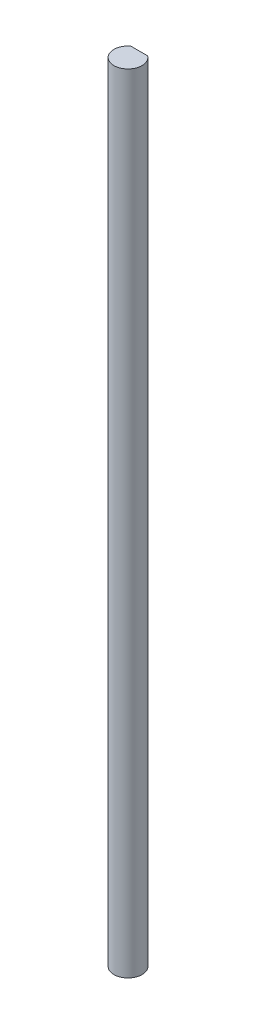
ISO-10303-21;
HEADER;
FILE_DESCRIPTION(('STEP AP214'),'2;1');
FILE_NAME('part.step','',(''),(''),'','','');
FILE_SCHEMA(('AUTOMOTIVE_DESIGN { 1 0 10303 214 1 1 1 1 }'));
ENDSEC;
DATA;
#1=APPLICATION_CONTEXT('core data for automotive mechanical design processes');
#2=APPLICATION_PROTOCOL_DEFINITION('international standard','automotive_design',2000,#1);
#3=PRODUCT_CONTEXT('',#1,'mechanical');
#4=PRODUCT('Part','Part','',(#3));
#5=PRODUCT_RELATED_PRODUCT_CATEGORY('part','',(#4));
#6=PRODUCT_DEFINITION_FORMATION('','',#4);
#7=PRODUCT_DEFINITION_CONTEXT('part definition',#1,'design');
#8=PRODUCT_DEFINITION('design','',#6,#7);
#9=PRODUCT_DEFINITION_SHAPE('','',#8);
#10=(LENGTH_UNIT() NAMED_UNIT(*) SI_UNIT(.MILLI.,.METRE.));
#11=(NAMED_UNIT(*) PLANE_ANGLE_UNIT() SI_UNIT($,.RADIAN.));
#12=(NAMED_UNIT(*) SI_UNIT($,.STERADIAN.) SOLID_ANGLE_UNIT());
#13=UNCERTAINTY_MEASURE_WITH_UNIT(LENGTH_MEASURE(1.E-05),#10,'distance_accuracy_value','');
#14=(GEOMETRIC_REPRESENTATION_CONTEXT(3) GLOBAL_UNCERTAINTY_ASSIGNED_CONTEXT((#13)) GLOBAL_UNIT_ASSIGNED_CONTEXT((#10,
#11,#12)) REPRESENTATION_CONTEXT('',''));
#15=CARTESIAN_POINT('',(0.,0.,0.));
#16=DIRECTION('',(0.,0.,1.));
#17=DIRECTION('',(1.,0.,0.));
#18=AXIS2_PLACEMENT_3D('',#15,#16,#17);
#19=CARTESIAN_POINT('',(0.,177.8,0.));
#20=DIRECTION('',(0.,-1.,0.));
#21=DIRECTION('',(0.,0.,-1.));
#22=AXIS2_PLACEMENT_3D('',#19,#20,#21);
#23=CYLINDRICAL_SURFACE('',#22,3.175);
#24=CARTESIAN_POINT('',(0.,0.,0.));
#25=DIRECTION('',(0.,1.,0.));
#26=DIRECTION('',(0.,0.,1.));
#27=AXIS2_PLACEMENT_3D('',#24,#25,#26);
#28=CIRCLE('',#27,3.175);
#29=CARTESIAN_POINT('',(-1.905,0.,-2.54));
#30=VERTEX_POINT('',#29);
#31=CARTESIAN_POINT('',(1.905,0.,-2.54));
#32=VERTEX_POINT('',#31);
#33=EDGE_CURVE('E64',#30,#32,#28,.T.);
#34=ORIENTED_EDGE('',*,*,#33,.T.);
#35=DIRECTION('',(0.,-1.,0.));
#36=VECTOR('',#35,1.);
#37=CARTESIAN_POINT('',(1.905,177.8,-2.54));
#38=LINE('',#37,#36);
#39=CARTESIAN_POINT('',(1.905,177.8,-2.54));
#40=VERTEX_POINT('',#39);
#41=EDGE_CURVE('E11',#40,#32,#38,.T.);
#42=ORIENTED_EDGE('',*,*,#41,.F.);
#43=CARTESIAN_POINT('',(0.,177.8,0.));
#44=DIRECTION('',(0.,1.,0.));
#45=DIRECTION('',(0.,0.,1.));
#46=AXIS2_PLACEMENT_3D('',#43,#44,#45);
#47=CIRCLE('',#46,3.175);
#48=CARTESIAN_POINT('',(-1.905,177.8,-2.54));
#49=VERTEX_POINT('',#48);
#50=EDGE_CURVE('E63',#49,#40,#47,.T.);
#51=ORIENTED_EDGE('',*,*,#50,.F.);
#52=DIRECTION('',(0.,-1.,0.));
#53=VECTOR('',#52,1.);
#54=CARTESIAN_POINT('',(-1.905,177.8,-2.54));
#55=LINE('',#54,#53);
#56=EDGE_CURVE('E41',#49,#30,#55,.T.);
#57=ORIENTED_EDGE('',*,*,#56,.T.);
#58=EDGE_LOOP('',(#34,#42,#51,#57));
#59=FACE_BOUND('',#58,.T.);
#60=ADVANCED_FACE('F33',(#59),#23,.T.);
#61=CARTESIAN_POINT('',(-1.905,177.8,-2.54));
#62=DIRECTION('',(0.,0.,1.));
#63=DIRECTION('',(1.,0.,0.));
#64=AXIS2_PLACEMENT_3D('',#61,#62,#63);
#65=PLANE('',#64);
#66=DIRECTION('',(-1.,0.,0.));
#67=VECTOR('',#66,1.);
#68=CARTESIAN_POINT('',(-1.905,0.,-2.54));
#69=LINE('',#68,#67);
#70=EDGE_CURVE('E56',#32,#30,#69,.T.);
#71=ORIENTED_EDGE('',*,*,#70,.T.);
#72=ORIENTED_EDGE('',*,*,#56,.F.);
#73=DIRECTION('',(-1.,0.,0.));
#74=VECTOR('',#73,1.);
#75=CARTESIAN_POINT('',(-1.905,177.8,-2.54));
#76=LINE('',#75,#74);
#77=EDGE_CURVE('E48',#40,#49,#76,.T.);
#78=ORIENTED_EDGE('',*,*,#77,.F.);
#79=ORIENTED_EDGE('',*,*,#41,.T.);
#80=EDGE_LOOP('',(#71,#72,#78,#79));
#81=FACE_BOUND('',#80,.T.);
#82=ADVANCED_FACE('F59',(#81),#65,.F.);
#83=CARTESIAN_POINT('',(0.,177.8,0.));
#84=DIRECTION('',(0.,1.,0.));
#85=DIRECTION('',(0.,0.,1.));
#86=AXIS2_PLACEMENT_3D('',#83,#84,#85);
#87=PLANE('',#86);
#88=ORIENTED_EDGE('',*,*,#50,.T.);
#89=ORIENTED_EDGE('',*,*,#77,.T.);
#90=EDGE_LOOP('',(#88,#89));
#91=FACE_BOUND('',#90,.T.);
#92=ADVANCED_FACE('F71',(#91),#87,.T.);
#93=CARTESIAN_POINT('',(0.,0.,0.));
#94=DIRECTION('',(0.,1.,0.));
#95=DIRECTION('',(0.,0.,1.));
#96=AXIS2_PLACEMENT_3D('',#93,#94,#95);
#97=PLANE('',#96);
#98=ORIENTED_EDGE('',*,*,#33,.F.);
#99=ORIENTED_EDGE('',*,*,#70,.F.);
#100=EDGE_LOOP('',(#98,#99));
#101=FACE_BOUND('',#100,.T.);
#102=ADVANCED_FACE('F67',(#101),#97,.F.);
#103=CLOSED_SHELL('',(#60,#82,#92,#102));
#104=MANIFOLD_SOLID_BREP('B2',#103);
#105=ADVANCED_BREP_SHAPE_REPRESENTATION('',(#18,#104),#14);
#106=SHAPE_DEFINITION_REPRESENTATION(#9,#105);
ENDSEC;
END-ISO-10303-21;
